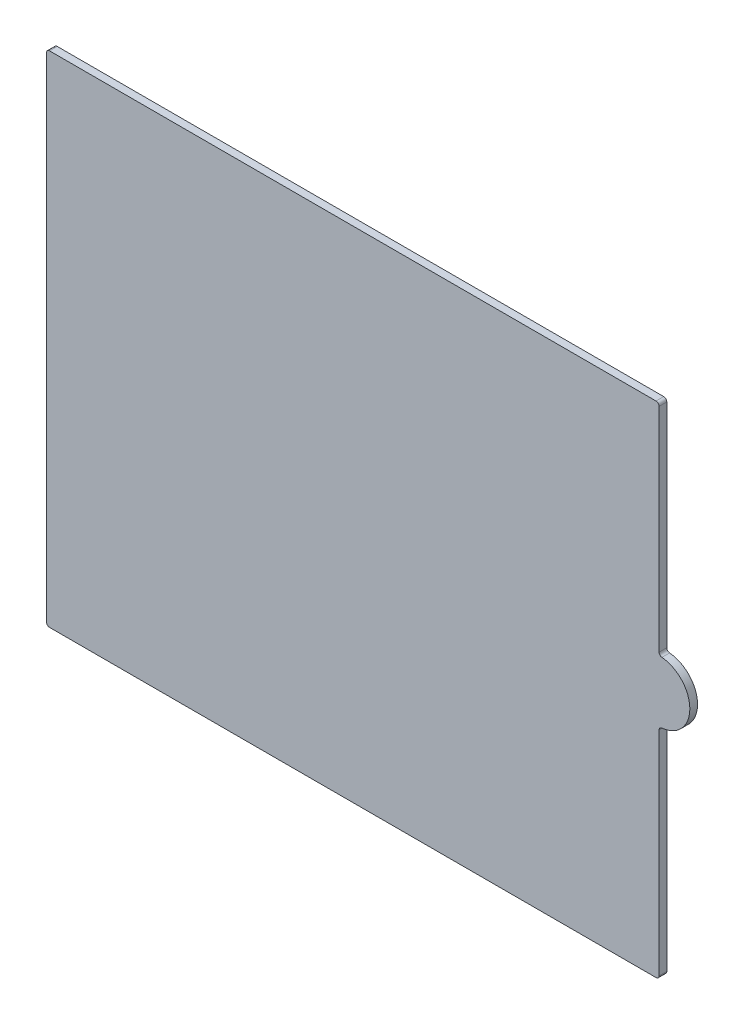
ISO-10303-21;
HEADER;
FILE_DESCRIPTION(('STEP AP214'),'2;1');
FILE_NAME('part.step','',(''),(''),'','','');
FILE_SCHEMA(('AUTOMOTIVE_DESIGN { 1 0 10303 214 1 1 1 1 }'));
ENDSEC;
DATA;
#1=APPLICATION_CONTEXT('core data for automotive mechanical design processes');
#2=APPLICATION_PROTOCOL_DEFINITION('international standard','automotive_design',2000,#1);
#3=PRODUCT_CONTEXT('',#1,'mechanical');
#4=PRODUCT('Part','Part','',(#3));
#5=PRODUCT_RELATED_PRODUCT_CATEGORY('part','',(#4));
#6=PRODUCT_DEFINITION_FORMATION('','',#4);
#7=PRODUCT_DEFINITION_CONTEXT('part definition',#1,'design');
#8=PRODUCT_DEFINITION('design','',#6,#7);
#9=PRODUCT_DEFINITION_SHAPE('','',#8);
#10=(LENGTH_UNIT() NAMED_UNIT(*) SI_UNIT(.MILLI.,.METRE.));
#11=(NAMED_UNIT(*) PLANE_ANGLE_UNIT() SI_UNIT($,.RADIAN.));
#12=(NAMED_UNIT(*) SI_UNIT($,.STERADIAN.) SOLID_ANGLE_UNIT());
#13=UNCERTAINTY_MEASURE_WITH_UNIT(LENGTH_MEASURE(1.E-05),#10,'distance_accuracy_value','');
#14=(GEOMETRIC_REPRESENTATION_CONTEXT(3) GLOBAL_UNCERTAINTY_ASSIGNED_CONTEXT((#13)) GLOBAL_UNIT_ASSIGNED_CONTEXT((#10,
#11,#12)) REPRESENTATION_CONTEXT('',''));
#15=CARTESIAN_POINT('',(0.,0.,0.));
#16=DIRECTION('',(0.,0.,1.));
#17=DIRECTION('',(1.,0.,0.));
#18=AXIS2_PLACEMENT_3D('',#15,#16,#17);
#19=CARTESIAN_POINT('',(253.1745,103.1748,3.175));
#20=DIRECTION('',(0.,0.,-1.));
#21=DIRECTION('',(-1.,0.,0.));
#22=AXIS2_PLACEMENT_3D('',#19,#20,#21);
#23=CYLINDRICAL_SURFACE('',#22,12.7);
#24=CARTESIAN_POINT('',(253.1745,103.1748,3.175));
#25=DIRECTION('',(0.,0.,1.));
#26=DIRECTION('',(1.,0.,0.));
#27=AXIS2_PLACEMENT_3D('',#24,#25,#26);
#28=CIRCLE('',#27,12.7);
#29=CARTESIAN_POINT('',(254.329045454545,90.527388217608,3.175));
#30=VERTEX_POINT('',#29);
#31=CARTESIAN_POINT('',(254.329045454545,115.822211782392,3.175));
#32=VERTEX_POINT('',#31);
#33=EDGE_CURVE('E164',#30,#32,#28,.T.);
#34=ORIENTED_EDGE('',*,*,#33,.F.);
#35=DIRECTION('',(0.,0.,-1.));
#36=VECTOR('',#35,1.);
#37=CARTESIAN_POINT('',(254.329045454545,90.527388217608,3.175));
#38=LINE('',#37,#36);
#39=CARTESIAN_POINT('',(254.329045454545,90.527388217608,0.));
#40=VERTEX_POINT('',#39);
#41=EDGE_CURVE('E192',#30,#40,#38,.T.);
#42=ORIENTED_EDGE('',*,*,#41,.T.);
#43=CARTESIAN_POINT('',(253.1745,103.1748,0.));
#44=DIRECTION('',(0.,0.,1.));
#45=DIRECTION('',(1.,0.,0.));
#46=AXIS2_PLACEMENT_3D('',#43,#44,#45);
#47=CIRCLE('',#46,12.7);
#48=CARTESIAN_POINT('',(254.329045454545,115.822211782392,0.));
#49=VERTEX_POINT('',#48);
#50=EDGE_CURVE('E206',#40,#49,#47,.T.);
#51=ORIENTED_EDGE('',*,*,#50,.T.);
#52=DIRECTION('',(0.,0.,-1.));
#53=VECTOR('',#52,1.);
#54=CARTESIAN_POINT('',(254.329045454545,115.822211782392,3.175));
#55=LINE('',#54,#53);
#56=EDGE_CURVE('E190',#49,#32,#55,.F.);
#57=ORIENTED_EDGE('',*,*,#56,.T.);
#58=EDGE_LOOP('',(#34,#42,#51,#57));
#59=FACE_BOUND('',#58,.T.);
#60=ADVANCED_FACE('F37',(#59),#23,.T.);
#61=CARTESIAN_POINT('',(253.1745,115.8748,3.175));
#62=DIRECTION('',(-1.,0.,0.));
#63=DIRECTION('',(0.,-1.,0.));
#64=AXIS2_PLACEMENT_3D('',#61,#62,#63);
#65=PLANE('',#64);
#66=DIRECTION('',(0.,1.,0.));
#67=VECTOR('',#66,1.);
#68=CARTESIAN_POINT('',(253.1745,115.8748,3.175));
#69=LINE('',#68,#67);
#70=CARTESIAN_POINT('',(253.1745,117.086952960631,3.175));
#71=VERTEX_POINT('',#70);
#72=CARTESIAN_POINT('',(253.1745,205.0796,3.175));
#73=VERTEX_POINT('',#72);
#74=EDGE_CURVE('E222',#71,#73,#69,.T.);
#75=ORIENTED_EDGE('',*,*,#74,.F.);
#76=DIRECTION('',(0.,0.,1.));
#77=VECTOR('',#76,1.);
#78=CARTESIAN_POINT('',(253.1745,117.086952960631,0.));
#79=LINE('',#78,#77);
#80=CARTESIAN_POINT('',(253.1745,117.086952960631,0.));
#81=VERTEX_POINT('',#80);
#82=EDGE_CURVE('E197',#71,#81,#79,.F.);
#83=ORIENTED_EDGE('',*,*,#82,.T.);
#84=DIRECTION('',(0.,1.,0.));
#85=VECTOR('',#84,1.);
#86=CARTESIAN_POINT('',(253.1745,115.8748,0.));
#87=LINE('',#86,#85);
#88=CARTESIAN_POINT('',(253.1745,205.0796,0.));
#89=VERTEX_POINT('',#88);
#90=EDGE_CURVE('E159',#81,#89,#87,.T.);
#91=ORIENTED_EDGE('',*,*,#90,.T.);
#92=DIRECTION('',(0.,0.,-1.));
#93=VECTOR('',#92,1.);
#94=CARTESIAN_POINT('',(253.1745,205.0796,3.175));
#95=LINE('',#94,#93);
#96=EDGE_CURVE('E195',#89,#73,#95,.F.);
#97=ORIENTED_EDGE('',*,*,#96,.T.);
#98=EDGE_LOOP('',(#75,#83,#91,#97));
#99=FACE_BOUND('',#98,.T.);
#100=ADVANCED_FACE('F225',(#99),#65,.F.);
#101=CARTESIAN_POINT('',(253.1745,206.3496,3.175));
#102=DIRECTION('',(0.,-1.,0.));
#103=DIRECTION('',(0.,0.,-1.));
#104=AXIS2_PLACEMENT_3D('',#101,#102,#103);
#105=PLANE('',#104);
#106=DIRECTION('',(-1.,0.,0.));
#107=VECTOR('',#106,1.);
#108=CARTESIAN_POINT('',(253.1745,206.3496,0.));
#109=LINE('',#108,#107);
#110=CARTESIAN_POINT('',(251.9045,206.3496,0.));
#111=VERTEX_POINT('',#110);
#112=CARTESIAN_POINT('',(1.26999999999999,206.3496,0.));
#113=VERTEX_POINT('',#112);
#114=EDGE_CURVE('E154',#111,#113,#109,.T.);
#115=ORIENTED_EDGE('',*,*,#114,.T.);
#116=DIRECTION('',(0.,0.,-1.));
#117=VECTOR('',#116,1.);
#118=CARTESIAN_POINT('',(1.26999999999999,206.3496,3.175));
#119=LINE('',#118,#117);
#120=CARTESIAN_POINT('',(1.26999999999999,206.3496,3.175));
#121=VERTEX_POINT('',#120);
#122=EDGE_CURVE('E132',#113,#121,#119,.F.);
#123=ORIENTED_EDGE('',*,*,#122,.T.);
#124=DIRECTION('',(-1.,0.,0.));
#125=VECTOR('',#124,1.);
#126=CARTESIAN_POINT('',(253.1745,206.3496,3.175));
#127=LINE('',#126,#125);
#128=CARTESIAN_POINT('',(251.9045,206.3496,3.175));
#129=VERTEX_POINT('',#128);
#130=EDGE_CURVE('E227',#129,#121,#127,.T.);
#131=ORIENTED_EDGE('',*,*,#130,.F.);
#132=DIRECTION('',(0.,0.,-1.));
#133=VECTOR('',#132,1.);
#134=CARTESIAN_POINT('',(251.9045,206.3496,3.175));
#135=LINE('',#134,#133);
#136=EDGE_CURVE('E137',#129,#111,#135,.T.);
#137=ORIENTED_EDGE('',*,*,#136,.T.);
#138=EDGE_LOOP('',(#115,#123,#131,#137));
#139=FACE_BOUND('',#138,.T.);
#140=ADVANCED_FACE('F239',(#139),#105,.F.);
#141=CARTESIAN_POINT('',(0.,206.3496,3.175));
#142=DIRECTION('',(1.,0.,0.));
#143=DIRECTION('',(0.,0.,-1.));
#144=AXIS2_PLACEMENT_3D('',#141,#142,#143);
#145=PLANE('',#144);
#146=DIRECTION('',(0.,-1.,0.));
#147=VECTOR('',#146,1.);
#148=CARTESIAN_POINT('',(0.,206.3496,3.175));
#149=LINE('',#148,#147);
#150=CARTESIAN_POINT('',(0.,205.0796,3.175));
#151=VERTEX_POINT('',#150);
#152=CARTESIAN_POINT('',(0.,1.26999999999999,3.175));
#153=VERTEX_POINT('',#152);
#154=EDGE_CURVE('E147',#151,#153,#149,.T.);
#155=ORIENTED_EDGE('',*,*,#154,.F.);
#156=DIRECTION('',(0.,0.,-1.));
#157=VECTOR('',#156,1.);
#158=CARTESIAN_POINT('',(0.,205.0796,3.175));
#159=LINE('',#158,#157);
#160=CARTESIAN_POINT('',(0.,205.0796,0.));
#161=VERTEX_POINT('',#160);
#162=EDGE_CURVE('E131',#151,#161,#159,.T.);
#163=ORIENTED_EDGE('',*,*,#162,.T.);
#164=DIRECTION('',(0.,-1.,0.));
#165=VECTOR('',#164,1.);
#166=CARTESIAN_POINT('',(0.,206.3496,0.));
#167=LINE('',#166,#165);
#168=CARTESIAN_POINT('',(0.,1.26999999999999,0.));
#169=VERTEX_POINT('',#168);
#170=EDGE_CURVE('E144',#161,#169,#167,.T.);
#171=ORIENTED_EDGE('',*,*,#170,.T.);
#172=DIRECTION('',(0.,0.,-1.));
#173=VECTOR('',#172,1.);
#174=CARTESIAN_POINT('',(0.,1.26999999999999,3.175));
#175=LINE('',#174,#173);
#176=EDGE_CURVE('E149',#169,#153,#175,.F.);
#177=ORIENTED_EDGE('',*,*,#176,.T.);
#178=EDGE_LOOP('',(#155,#163,#171,#177));
#179=FACE_BOUND('',#178,.T.);
#180=ADVANCED_FACE('F143',(#179),#145,.F.);
#181=CARTESIAN_POINT('',(0.,0.,3.175));
#182=DIRECTION('',(0.,1.,0.));
#183=DIRECTION('',(0.,0.,1.));
#184=AXIS2_PLACEMENT_3D('',#181,#182,#183);
#185=PLANE('',#184);
#186=DIRECTION('',(1.,0.,0.));
#187=VECTOR('',#186,1.);
#188=CARTESIAN_POINT('',(0.,0.,3.175));
#189=LINE('',#188,#187);
#190=CARTESIAN_POINT('',(1.27,0.,3.175));
#191=VERTEX_POINT('',#190);
#192=CARTESIAN_POINT('',(251.9045,0.,3.175));
#193=VERTEX_POINT('',#192);
#194=EDGE_CURVE('E233',#191,#193,#189,.T.);
#195=ORIENTED_EDGE('',*,*,#194,.F.);
#196=DIRECTION('',(0.,0.,-1.));
#197=VECTOR('',#196,1.);
#198=CARTESIAN_POINT('',(1.27,0.,3.175));
#199=LINE('',#198,#197);
#200=CARTESIAN_POINT('',(1.27,0.,0.));
#201=VERTEX_POINT('',#200);
#202=EDGE_CURVE('E183',#191,#201,#199,.T.);
#203=ORIENTED_EDGE('',*,*,#202,.T.);
#204=DIRECTION('',(1.,0.,0.));
#205=VECTOR('',#204,1.);
#206=CARTESIAN_POINT('',(0.,0.,0.));
#207=LINE('',#206,#205);
#208=CARTESIAN_POINT('',(251.9045,0.,0.));
#209=VERTEX_POINT('',#208);
#210=EDGE_CURVE('E153',#201,#209,#207,.T.);
#211=ORIENTED_EDGE('',*,*,#210,.T.);
#212=DIRECTION('',(0.,0.,-1.));
#213=VECTOR('',#212,1.);
#214=CARTESIAN_POINT('',(251.9045,0.,3.175));
#215=LINE('',#214,#213);
#216=EDGE_CURVE('E181',#209,#193,#215,.F.);
#217=ORIENTED_EDGE('',*,*,#216,.T.);
#218=EDGE_LOOP('',(#195,#203,#211,#217));
#219=FACE_BOUND('',#218,.T.);
#220=ADVANCED_FACE('F246',(#219),#185,.F.);
#221=CARTESIAN_POINT('',(253.1745,0.,3.175));
#222=DIRECTION('',(-1.,0.,0.));
#223=DIRECTION('',(0.,-1.,0.));
#224=AXIS2_PLACEMENT_3D('',#221,#222,#223);
#225=PLANE('',#224);
#226=DIRECTION('',(0.,1.,0.));
#227=VECTOR('',#226,1.);
#228=CARTESIAN_POINT('',(253.1745,0.,3.175));
#229=LINE('',#228,#227);
#230=CARTESIAN_POINT('',(253.1745,1.27,3.175));
#231=VERTEX_POINT('',#230);
#232=CARTESIAN_POINT('',(253.1745,89.2626470393688,3.175));
#233=VERTEX_POINT('',#232);
#234=EDGE_CURVE('E165',#231,#233,#229,.T.);
#235=ORIENTED_EDGE('',*,*,#234,.F.);
#236=DIRECTION('',(0.,0.,-1.));
#237=VECTOR('',#236,1.);
#238=CARTESIAN_POINT('',(253.1745,1.27,3.175));
#239=LINE('',#238,#237);
#240=CARTESIAN_POINT('',(253.1745,1.27,0.));
#241=VERTEX_POINT('',#240);
#242=EDGE_CURVE('E187',#231,#241,#239,.T.);
#243=ORIENTED_EDGE('',*,*,#242,.T.);
#244=DIRECTION('',(0.,1.,0.));
#245=VECTOR('',#244,1.);
#246=CARTESIAN_POINT('',(253.1745,0.,0.));
#247=LINE('',#246,#245);
#248=CARTESIAN_POINT('',(253.1745,89.2626470393688,0.));
#249=VERTEX_POINT('',#248);
#250=EDGE_CURVE('E157',#241,#249,#247,.T.);
#251=ORIENTED_EDGE('',*,*,#250,.T.);
#252=DIRECTION('',(0.,0.,1.));
#253=VECTOR('',#252,1.);
#254=CARTESIAN_POINT('',(253.1745,89.2626470393688,3.175));
#255=LINE('',#254,#253);
#256=EDGE_CURVE('E52',#249,#233,#255,.T.);
#257=ORIENTED_EDGE('',*,*,#256,.T.);
#258=EDGE_LOOP('',(#235,#243,#251,#257));
#259=FACE_BOUND('',#258,.T.);
#260=ADVANCED_FACE('F318',(#259),#225,.F.);
#261=CARTESIAN_POINT('',(253.1745,103.1748,3.175));
#262=DIRECTION('',(0.,0.,1.));
#263=DIRECTION('',(1.,0.,0.));
#264=AXIS2_PLACEMENT_3D('',#261,#262,#263);
#265=PLANE('',#264);
#266=ORIENTED_EDGE('',*,*,#130,.T.);
#267=CARTESIAN_POINT('',(1.27,205.0796,3.175));
#268=DIRECTION('',(0.,0.,1.));
#269=DIRECTION('',(1.,0.,0.));
#270=AXIS2_PLACEMENT_3D('',#267,#268,#269);
#271=CIRCLE('',#270,1.27);
#272=EDGE_CURVE('E179',#121,#151,#271,.T.);
#273=ORIENTED_EDGE('',*,*,#272,.T.);
#274=ORIENTED_EDGE('',*,*,#154,.T.);
#275=CARTESIAN_POINT('',(1.27,1.27,3.175));
#276=DIRECTION('',(0.,0.,1.));
#277=DIRECTION('',(1.,0.,0.));
#278=AXIS2_PLACEMENT_3D('',#275,#276,#277);
#279=CIRCLE('',#278,1.27);
#280=EDGE_CURVE('E177',#153,#191,#279,.T.);
#281=ORIENTED_EDGE('',*,*,#280,.T.);
#282=ORIENTED_EDGE('',*,*,#194,.T.);
#283=CARTESIAN_POINT('',(251.9045,1.27,3.175));
#284=DIRECTION('',(0.,0.,1.));
#285=DIRECTION('',(1.,0.,0.));
#286=AXIS2_PLACEMENT_3D('',#283,#284,#285);
#287=CIRCLE('',#286,1.27);
#288=EDGE_CURVE('E59',#193,#231,#287,.T.);
#289=ORIENTED_EDGE('',*,*,#288,.T.);
#290=ORIENTED_EDGE('',*,*,#234,.T.);
#291=CARTESIAN_POINT('',(254.4445,89.2626470393688,3.175));
#292=DIRECTION('',(0.,0.,1.));
#293=DIRECTION('',(1.,0.,0.));
#294=AXIS2_PLACEMENT_3D('',#291,#292,#293);
#295=CIRCLE('',#294,1.27);
#296=EDGE_CURVE('E202',#233,#30,#295,.F.);
#297=ORIENTED_EDGE('',*,*,#296,.T.);
#298=ORIENTED_EDGE('',*,*,#33,.T.);
#299=CARTESIAN_POINT('',(254.4445,117.086952960631,3.175));
#300=DIRECTION('',(0.,0.,1.));
#301=DIRECTION('',(1.,0.,0.));
#302=AXIS2_PLACEMENT_3D('',#299,#300,#301);
#303=CIRCLE('',#302,1.27);
#304=EDGE_CURVE('E11',#32,#71,#303,.F.);
#305=ORIENTED_EDGE('',*,*,#304,.T.);
#306=ORIENTED_EDGE('',*,*,#74,.T.);
#307=CARTESIAN_POINT('',(251.9045,205.0796,3.175));
#308=DIRECTION('',(0.,0.,1.));
#309=DIRECTION('',(1.,0.,0.));
#310=AXIS2_PLACEMENT_3D('',#307,#308,#309);
#311=CIRCLE('',#310,1.27);
#312=EDGE_CURVE('E174',#73,#129,#311,.T.);
#313=ORIENTED_EDGE('',*,*,#312,.T.);
#314=EDGE_LOOP('',(#266,#273,#274,#281,#282,#289,#290,#297,#298,#305,#306,#313));
#315=FACE_BOUND('',#314,.T.);
#316=ADVANCED_FACE('F221',(#315),#265,.T.);
#317=CARTESIAN_POINT('',(253.1745,103.1748,0.));
#318=DIRECTION('',(0.,0.,1.));
#319=DIRECTION('',(1.,0.,0.));
#320=AXIS2_PLACEMENT_3D('',#317,#318,#319);
#321=PLANE('',#320);
#322=ORIENTED_EDGE('',*,*,#170,.F.);
#323=CARTESIAN_POINT('',(1.27,205.0796,0.));
#324=DIRECTION('',(0.,0.,1.));
#325=DIRECTION('',(1.,0.,0.));
#326=AXIS2_PLACEMENT_3D('',#323,#324,#325);
#327=CIRCLE('',#326,1.27);
#328=EDGE_CURVE('E127',#161,#113,#327,.F.);
#329=ORIENTED_EDGE('',*,*,#328,.T.);
#330=ORIENTED_EDGE('',*,*,#114,.F.);
#331=CARTESIAN_POINT('',(251.9045,205.0796,0.));
#332=DIRECTION('',(0.,0.,1.));
#333=DIRECTION('',(1.,0.,0.));
#334=AXIS2_PLACEMENT_3D('',#331,#332,#333);
#335=CIRCLE('',#334,1.27);
#336=EDGE_CURVE('E148',#111,#89,#335,.F.);
#337=ORIENTED_EDGE('',*,*,#336,.T.);
#338=ORIENTED_EDGE('',*,*,#90,.F.);
#339=CARTESIAN_POINT('',(254.4445,117.086952960631,0.));
#340=DIRECTION('',(0.,0.,1.));
#341=DIRECTION('',(1.,0.,0.));
#342=AXIS2_PLACEMENT_3D('',#339,#340,#341);
#343=CIRCLE('',#342,1.27);
#344=EDGE_CURVE('E45',#81,#49,#343,.T.);
#345=ORIENTED_EDGE('',*,*,#344,.T.);
#346=ORIENTED_EDGE('',*,*,#50,.F.);
#347=CARTESIAN_POINT('',(254.4445,89.2626470393688,0.));
#348=DIRECTION('',(0.,0.,1.));
#349=DIRECTION('',(1.,0.,0.));
#350=AXIS2_PLACEMENT_3D('',#347,#348,#349);
#351=CIRCLE('',#350,1.27);
#352=EDGE_CURVE('E200',#40,#249,#351,.T.);
#353=ORIENTED_EDGE('',*,*,#352,.T.);
#354=ORIENTED_EDGE('',*,*,#250,.F.);
#355=CARTESIAN_POINT('',(251.9045,1.27,0.));
#356=DIRECTION('',(0.,0.,1.));
#357=DIRECTION('',(1.,0.,0.));
#358=AXIS2_PLACEMENT_3D('',#355,#356,#357);
#359=CIRCLE('',#358,1.27);
#360=EDGE_CURVE('E168',#241,#209,#359,.F.);
#361=ORIENTED_EDGE('',*,*,#360,.T.);
#362=ORIENTED_EDGE('',*,*,#210,.F.);
#363=CARTESIAN_POINT('',(1.27,1.27,0.));
#364=DIRECTION('',(0.,0.,1.));
#365=DIRECTION('',(1.,0.,0.));
#366=AXIS2_PLACEMENT_3D('',#363,#364,#365);
#367=CIRCLE('',#366,1.27);
#368=EDGE_CURVE('E138',#201,#169,#367,.F.);
#369=ORIENTED_EDGE('',*,*,#368,.T.);
#370=EDGE_LOOP('',(#322,#329,#330,#337,#338,#345,#346,#353,#354,#361,#362,#369));
#371=FACE_BOUND('',#370,.T.);
#372=ADVANCED_FACE('F151',(#371),#321,.F.);
#373=CARTESIAN_POINT('',(1.27,205.0796,3.175));
#374=DIRECTION('',(0.,0.,-1.));
#375=DIRECTION('',(-1.,0.,0.));
#376=AXIS2_PLACEMENT_3D('',#373,#374,#375);
#377=CYLINDRICAL_SURFACE('',#376,1.27);
#378=ORIENTED_EDGE('',*,*,#272,.F.);
#379=ORIENTED_EDGE('',*,*,#122,.F.);
#380=ORIENTED_EDGE('',*,*,#328,.F.);
#381=ORIENTED_EDGE('',*,*,#162,.F.);
#382=EDGE_LOOP('',(#378,#379,#380,#381));
#383=FACE_BOUND('',#382,.T.);
#384=ADVANCED_FACE('F130',(#383),#377,.T.);
#385=CARTESIAN_POINT('',(1.27,1.27,3.175));
#386=DIRECTION('',(0.,0.,-1.));
#387=DIRECTION('',(-1.,0.,0.));
#388=AXIS2_PLACEMENT_3D('',#385,#386,#387);
#389=CYLINDRICAL_SURFACE('',#388,1.27);
#390=ORIENTED_EDGE('',*,*,#280,.F.);
#391=ORIENTED_EDGE('',*,*,#176,.F.);
#392=ORIENTED_EDGE('',*,*,#368,.F.);
#393=ORIENTED_EDGE('',*,*,#202,.F.);
#394=EDGE_LOOP('',(#390,#391,#392,#393));
#395=FACE_BOUND('',#394,.T.);
#396=ADVANCED_FACE('F256',(#395),#389,.T.);
#397=CARTESIAN_POINT('',(251.9045,1.27,3.175));
#398=DIRECTION('',(0.,0.,-1.));
#399=DIRECTION('',(-1.,0.,0.));
#400=AXIS2_PLACEMENT_3D('',#397,#398,#399);
#401=CYLINDRICAL_SURFACE('',#400,1.27);
#402=ORIENTED_EDGE('',*,*,#288,.F.);
#403=ORIENTED_EDGE('',*,*,#216,.F.);
#404=ORIENTED_EDGE('',*,*,#360,.F.);
#405=ORIENTED_EDGE('',*,*,#242,.F.);
#406=EDGE_LOOP('',(#402,#403,#404,#405));
#407=FACE_BOUND('',#406,.T.);
#408=ADVANCED_FACE('F259',(#407),#401,.T.);
#409=CARTESIAN_POINT('',(254.4445,89.2626470393688,3.175));
#410=DIRECTION('',(0.,0.,-1.));
#411=DIRECTION('',(-1.,0.,0.));
#412=AXIS2_PLACEMENT_3D('',#409,#410,#411);
#413=CYLINDRICAL_SURFACE('',#412,1.27);
#414=ORIENTED_EDGE('',*,*,#296,.F.);
#415=ORIENTED_EDGE('',*,*,#256,.F.);
#416=ORIENTED_EDGE('',*,*,#352,.F.);
#417=ORIENTED_EDGE('',*,*,#41,.F.);
#418=EDGE_LOOP('',(#414,#415,#416,#417));
#419=FACE_BOUND('',#418,.T.);
#420=ADVANCED_FACE('F263',(#419),#413,.F.);
#421=CARTESIAN_POINT('',(254.4445,117.086952960631,3.175));
#422=DIRECTION('',(0.,0.,-1.));
#423=DIRECTION('',(-1.,0.,0.));
#424=AXIS2_PLACEMENT_3D('',#421,#422,#423);
#425=CYLINDRICAL_SURFACE('',#424,1.27);
#426=ORIENTED_EDGE('',*,*,#304,.F.);
#427=ORIENTED_EDGE('',*,*,#56,.F.);
#428=ORIENTED_EDGE('',*,*,#344,.F.);
#429=ORIENTED_EDGE('',*,*,#82,.F.);
#430=EDGE_LOOP('',(#426,#427,#428,#429));
#431=FACE_BOUND('',#430,.T.);
#432=ADVANCED_FACE('F217',(#431),#425,.F.);
#433=CARTESIAN_POINT('',(251.9045,205.0796,3.175));
#434=DIRECTION('',(0.,0.,-1.));
#435=DIRECTION('',(-1.,0.,0.));
#436=AXIS2_PLACEMENT_3D('',#433,#434,#435);
#437=CYLINDRICAL_SURFACE('',#436,1.27);
#438=ORIENTED_EDGE('',*,*,#312,.F.);
#439=ORIENTED_EDGE('',*,*,#96,.F.);
#440=ORIENTED_EDGE('',*,*,#336,.F.);
#441=ORIENTED_EDGE('',*,*,#136,.F.);
#442=EDGE_LOOP('',(#438,#439,#440,#441));
#443=FACE_BOUND('',#442,.T.);
#444=ADVANCED_FACE('F39',(#443),#437,.T.);
#445=CLOSED_SHELL('',(#60,#100,#140,#180,#220,#260,#316,#372,#384,#396,#408,#420,#432,#444));
#446=MANIFOLD_SOLID_BREP('B2',#445);
#447=ADVANCED_BREP_SHAPE_REPRESENTATION('',(#18,#446),#14);
#448=SHAPE_DEFINITION_REPRESENTATION(#9,#447);
ENDSEC;
END-ISO-10303-21;
